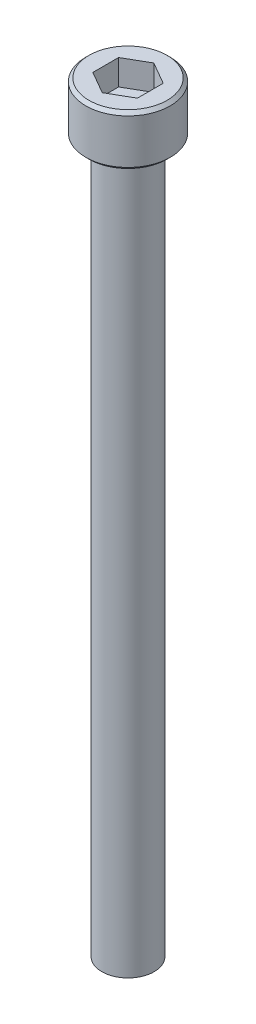
ISO-10303-21;
HEADER;
FILE_DESCRIPTION(('STEP AP214'),'2;1');
FILE_NAME('part.step','',(''),(''),'','','');
FILE_SCHEMA(('AUTOMOTIVE_DESIGN { 1 0 10303 214 1 1 1 1 }'));
ENDSEC;
DATA;
#1=APPLICATION_CONTEXT('core data for automotive mechanical design processes');
#2=APPLICATION_PROTOCOL_DEFINITION('international standard','automotive_design',2000,#1);
#3=PRODUCT_CONTEXT('',#1,'mechanical');
#4=PRODUCT('Part','Part','',(#3));
#5=PRODUCT_RELATED_PRODUCT_CATEGORY('part','',(#4));
#6=PRODUCT_DEFINITION_FORMATION('','',#4);
#7=PRODUCT_DEFINITION_CONTEXT('part definition',#1,'design');
#8=PRODUCT_DEFINITION('design','',#6,#7);
#9=PRODUCT_DEFINITION_SHAPE('','',#8);
#10=(LENGTH_UNIT() NAMED_UNIT(*) SI_UNIT(.MILLI.,.METRE.));
#11=(NAMED_UNIT(*) PLANE_ANGLE_UNIT() SI_UNIT($,.RADIAN.));
#12=(NAMED_UNIT(*) SI_UNIT($,.STERADIAN.) SOLID_ANGLE_UNIT());
#13=UNCERTAINTY_MEASURE_WITH_UNIT(LENGTH_MEASURE(1.E-05),#10,'distance_accuracy_value','');
#14=(GEOMETRIC_REPRESENTATION_CONTEXT(3) GLOBAL_UNCERTAINTY_ASSIGNED_CONTEXT((#13)) GLOBAL_UNIT_ASSIGNED_CONTEXT((#10,
#11,#12)) REPRESENTATION_CONTEXT('',''));
#15=CARTESIAN_POINT('',(0.,0.,0.));
#16=DIRECTION('',(0.,0.,1.));
#17=DIRECTION('',(1.,0.,0.));
#18=AXIS2_PLACEMENT_3D('',#15,#16,#17);
#19=CARTESIAN_POINT('',(1.778,2.032,3.07958633585746));
#20=DIRECTION('',(0.,1.,0.));
#21=DIRECTION('',(0.,0.,1.));
#22=AXIS2_PLACEMENT_3D('',#19,#20,#21);
#23=PLANE('',#22);
#24=DIRECTION('',(-0.866025403784439,0.,0.5));
#25=VECTOR('',#24,1.);
#26=CARTESIAN_POINT('',(0.,2.032,-2.05305755723831));
#27=LINE('',#26,#25);
#28=CARTESIAN_POINT('',(0.,2.032,-2.05305755723831));
#29=VERTEX_POINT('',#28);
#30=CARTESIAN_POINT('',(-1.778,2.032,-1.02652877861915));
#31=VERTEX_POINT('',#30);
#32=EDGE_CURVE('E67',#29,#31,#27,.T.);
#33=ORIENTED_EDGE('',*,*,#32,.T.);
#34=DIRECTION('',(0.,0.,1.));
#35=VECTOR('',#34,1.);
#36=CARTESIAN_POINT('',(-1.778,2.032,-1.02652877861915));
#37=LINE('',#36,#35);
#38=CARTESIAN_POINT('',(-1.778,2.032,1.02652877861915));
#39=VERTEX_POINT('',#38);
#40=EDGE_CURVE('E69',#31,#39,#37,.T.);
#41=ORIENTED_EDGE('',*,*,#40,.T.);
#42=DIRECTION('',(0.866025403784439,0.,0.499999999999999));
#43=VECTOR('',#42,1.);
#44=CARTESIAN_POINT('',(-1.778,2.032,1.02652877861915));
#45=LINE('',#44,#43);
#46=CARTESIAN_POINT('',(0.,2.032,2.05305755723831));
#47=VERTEX_POINT('',#46);
#48=EDGE_CURVE('E71',#39,#47,#45,.T.);
#49=ORIENTED_EDGE('',*,*,#48,.T.);
#50=DIRECTION('',(0.866025403784439,0.,-0.5));
#51=VECTOR('',#50,1.);
#52=CARTESIAN_POINT('',(0.,2.032,2.05305755723831));
#53=LINE('',#52,#51);
#54=CARTESIAN_POINT('',(1.778,2.032,1.02652877861915));
#55=VERTEX_POINT('',#54);
#56=EDGE_CURVE('E126',#47,#55,#53,.T.);
#57=ORIENTED_EDGE('',*,*,#56,.T.);
#58=DIRECTION('',(0.,0.,-1.));
#59=VECTOR('',#58,1.);
#60=CARTESIAN_POINT('',(1.778,2.032,1.02652877861915));
#61=LINE('',#60,#59);
#62=CARTESIAN_POINT('',(1.778,2.032,-1.02652877861915));
#63=VERTEX_POINT('',#62);
#64=EDGE_CURVE('E131',#55,#63,#61,.T.);
#65=ORIENTED_EDGE('',*,*,#64,.T.);
#66=DIRECTION('',(-0.866025403784439,0.,-0.5));
#67=VECTOR('',#66,1.);
#68=CARTESIAN_POINT('',(1.778,2.032,-1.02652877861916));
#69=LINE('',#68,#67);
#70=EDGE_CURVE('E135',#63,#29,#69,.T.);
#71=ORIENTED_EDGE('',*,*,#70,.T.);
#72=EDGE_LOOP('',(#33,#41,#49,#57,#65,#71));
#73=FACE_BOUND('',#72,.T.);
#74=ADVANCED_FACE('F16',(#73),#23,.T.);
#75=CARTESIAN_POINT('',(-1.778,2.032,1.02652877861915));
#76=DIRECTION('',(-0.499999999999999,0.,0.866025403784439));
#77=DIRECTION('',(0.866025403784439,0.,0.499999999999999));
#78=AXIS2_PLACEMENT_3D('',#75,#76,#77);
#79=PLANE('',#78);
#80=DIRECTION('',(0.,1.,0.));
#81=VECTOR('',#80,1.);
#82=CARTESIAN_POINT('',(0.,2.032,2.05305755723831));
#83=LINE('',#82,#81);
#84=CARTESIAN_POINT('',(0.,4.064,2.05305755723831));
#85=VERTEX_POINT('',#84);
#86=EDGE_CURVE('E82',#85,#47,#83,.F.);
#87=ORIENTED_EDGE('',*,*,#86,.T.);
#88=ORIENTED_EDGE('',*,*,#48,.F.);
#89=DIRECTION('',(0.,1.,0.));
#90=VECTOR('',#89,1.);
#91=CARTESIAN_POINT('',(-1.778,2.032,1.02652877861915));
#92=LINE('',#91,#90);
#93=CARTESIAN_POINT('',(-1.778,4.064,1.02652877861915));
#94=VERTEX_POINT('',#93);
#95=EDGE_CURVE('E76',#39,#94,#92,.T.);
#96=ORIENTED_EDGE('',*,*,#95,.T.);
#97=DIRECTION('',(-0.866025403784439,0.,-0.499999999999999));
#98=VECTOR('',#97,1.);
#99=CARTESIAN_POINT('',(0.,4.064,2.05305755723831));
#100=LINE('',#99,#98);
#101=EDGE_CURVE('E123',#85,#94,#100,.T.);
#102=ORIENTED_EDGE('',*,*,#101,.F.);
#103=EDGE_LOOP('',(#87,#88,#96,#102));
#104=FACE_BOUND('',#103,.T.);
#105=ADVANCED_FACE('F79',(#104),#79,.F.);
#106=CARTESIAN_POINT('',(-1.778,2.032,-1.02652877861915));
#107=DIRECTION('',(-1.,0.,0.));
#108=DIRECTION('',(0.,0.,1.));
#109=AXIS2_PLACEMENT_3D('',#106,#107,#108);
#110=PLANE('',#109);
#111=ORIENTED_EDGE('',*,*,#95,.F.);
#112=ORIENTED_EDGE('',*,*,#40,.F.);
#113=DIRECTION('',(0.,1.,0.));
#114=VECTOR('',#113,1.);
#115=CARTESIAN_POINT('',(-1.778,2.032,-1.02652877861915));
#116=LINE('',#115,#114);
#117=CARTESIAN_POINT('',(-1.778,4.064,-1.02652877861915));
#118=VERTEX_POINT('',#117);
#119=EDGE_CURVE('E90',#31,#118,#116,.T.);
#120=ORIENTED_EDGE('',*,*,#119,.T.);
#121=DIRECTION('',(0.,0.,1.));
#122=VECTOR('',#121,1.);
#123=CARTESIAN_POINT('',(-1.778,4.064,0.));
#124=LINE('',#123,#122);
#125=EDGE_CURVE('E87',#94,#118,#124,.F.);
#126=ORIENTED_EDGE('',*,*,#125,.F.);
#127=EDGE_LOOP('',(#111,#112,#120,#126));
#128=FACE_BOUND('',#127,.T.);
#129=ADVANCED_FACE('F85',(#128),#110,.F.);
#130=CARTESIAN_POINT('',(0.,2.032,-2.05305755723831));
#131=DIRECTION('',(-0.5,0.,-0.866025403784439));
#132=DIRECTION('',(-0.866025403784439,0.,0.5));
#133=AXIS2_PLACEMENT_3D('',#130,#131,#132);
#134=PLANE('',#133);
#135=ORIENTED_EDGE('',*,*,#119,.F.);
#136=ORIENTED_EDGE('',*,*,#32,.F.);
#137=DIRECTION('',(0.,1.,0.));
#138=VECTOR('',#137,1.);
#139=CARTESIAN_POINT('',(0.,2.032,-2.05305755723831));
#140=LINE('',#139,#138);
#141=CARTESIAN_POINT('',(0.,4.064,-2.05305755723831));
#142=VERTEX_POINT('',#141);
#143=EDGE_CURVE('E133',#29,#142,#140,.T.);
#144=ORIENTED_EDGE('',*,*,#143,.T.);
#145=DIRECTION('',(0.866025403784438,0.,-0.5));
#146=VECTOR('',#145,1.);
#147=CARTESIAN_POINT('',(-1.778,4.064,-1.02652877861915));
#148=LINE('',#147,#146);
#149=EDGE_CURVE('E119',#118,#142,#148,.T.);
#150=ORIENTED_EDGE('',*,*,#149,.F.);
#151=EDGE_LOOP('',(#135,#136,#144,#150));
#152=FACE_BOUND('',#151,.T.);
#153=ADVANCED_FACE('F138',(#152),#134,.F.);
#154=CARTESIAN_POINT('',(1.778,2.032,-1.02652877861916));
#155=DIRECTION('',(0.5,0.,-0.866025403784439));
#156=DIRECTION('',(-0.866025403784439,0.,-0.5));
#157=AXIS2_PLACEMENT_3D('',#154,#155,#156);
#158=PLANE('',#157);
#159=ORIENTED_EDGE('',*,*,#143,.F.);
#160=ORIENTED_EDGE('',*,*,#70,.F.);
#161=DIRECTION('',(0.,1.,0.));
#162=VECTOR('',#161,1.);
#163=CARTESIAN_POINT('',(1.778,2.032,-1.02652877861916));
#164=LINE('',#163,#162);
#165=CARTESIAN_POINT('',(1.778,4.064,-1.02652877861916));
#166=VERTEX_POINT('',#165);
#167=EDGE_CURVE('E129',#63,#166,#164,.T.);
#168=ORIENTED_EDGE('',*,*,#167,.T.);
#169=DIRECTION('',(0.866025403784439,0.,0.5));
#170=VECTOR('',#169,1.);
#171=CARTESIAN_POINT('',(0.,4.064,-2.05305755723831));
#172=LINE('',#171,#170);
#173=EDGE_CURVE('E116',#142,#166,#172,.T.);
#174=ORIENTED_EDGE('',*,*,#173,.F.);
#175=EDGE_LOOP('',(#159,#160,#168,#174));
#176=FACE_BOUND('',#175,.T.);
#177=ADVANCED_FACE('F150',(#176),#158,.F.);
#178=CARTESIAN_POINT('',(1.778,2.032,1.02652877861915));
#179=DIRECTION('',(1.,0.,0.));
#180=DIRECTION('',(0.,0.,-1.));
#181=AXIS2_PLACEMENT_3D('',#178,#179,#180);
#182=PLANE('',#181);
#183=ORIENTED_EDGE('',*,*,#167,.F.);
#184=ORIENTED_EDGE('',*,*,#64,.F.);
#185=DIRECTION('',(0.,1.,0.));
#186=VECTOR('',#185,1.);
#187=CARTESIAN_POINT('',(1.778,2.032,1.02652877861915));
#188=LINE('',#187,#186);
#189=CARTESIAN_POINT('',(1.778,4.064,1.02652877861915));
#190=VERTEX_POINT('',#189);
#191=EDGE_CURVE('E34',#55,#190,#188,.T.);
#192=ORIENTED_EDGE('',*,*,#191,.T.);
#193=DIRECTION('',(0.,0.,1.));
#194=VECTOR('',#193,1.);
#195=CARTESIAN_POINT('',(1.778,4.064,0.));
#196=LINE('',#195,#194);
#197=EDGE_CURVE('E113',#166,#190,#196,.T.);
#198=ORIENTED_EDGE('',*,*,#197,.F.);
#199=EDGE_LOOP('',(#183,#184,#192,#198));
#200=FACE_BOUND('',#199,.T.);
#201=ADVANCED_FACE('F148',(#200),#182,.F.);
#202=CARTESIAN_POINT('',(0.,2.032,2.05305755723831));
#203=DIRECTION('',(0.5,0.,0.866025403784439));
#204=DIRECTION('',(0.866025403784439,0.,-0.5));
#205=AXIS2_PLACEMENT_3D('',#202,#203,#204);
#206=PLANE('',#205);
#207=ORIENTED_EDGE('',*,*,#191,.F.);
#208=ORIENTED_EDGE('',*,*,#56,.F.);
#209=ORIENTED_EDGE('',*,*,#86,.F.);
#210=DIRECTION('',(-0.866025403784438,0.,0.5));
#211=VECTOR('',#210,1.);
#212=CARTESIAN_POINT('',(1.778,4.064,1.02652877861915));
#213=LINE('',#212,#211);
#214=EDGE_CURVE('E110',#190,#85,#213,.T.);
#215=ORIENTED_EDGE('',*,*,#214,.F.);
#216=EDGE_LOOP('',(#207,#208,#209,#215));
#217=FACE_BOUND('',#216,.T.);
#218=ADVANCED_FACE('F145',(#217),#206,.F.);
#219=CARTESIAN_POINT('',(0.,4.064,0.));
#220=DIRECTION('',(0.,1.,0.));
#221=DIRECTION('',(0.,0.,1.));
#222=AXIS2_PLACEMENT_3D('',#219,#220,#221);
#223=PLANE('',#222);
#224=ORIENTED_EDGE('',*,*,#197,.T.);
#225=ORIENTED_EDGE('',*,*,#214,.T.);
#226=ORIENTED_EDGE('',*,*,#101,.T.);
#227=ORIENTED_EDGE('',*,*,#125,.T.);
#228=ORIENTED_EDGE('',*,*,#149,.T.);
#229=ORIENTED_EDGE('',*,*,#173,.T.);
#230=EDGE_LOOP('',(#224,#225,#226,#227,#228,#229));
#231=FACE_BOUND('',#230,.T.);
#232=CARTESIAN_POINT('',(0.,4.0639999999712,0.));
#233=DIRECTION('',(0.,-1.,0.));
#234=DIRECTION('',(0.,0.,-1.));
#235=AXIS2_PLACEMENT_3D('',#232,#233,#234);
#236=CIRCLE('',#235,3.11149999998861);
#237=CARTESIAN_POINT('',(0.,4.0639999999712,-3.11149999998861));
#238=VERTEX_POINT('',#237);
#239=EDGE_CURVE('E19',#238,#238,#236,.T.);
#240=ORIENTED_EDGE('',*,*,#239,.F.);
#241=EDGE_LOOP('',(#240));
#242=FACE_BOUND('',#241,.T.);
#243=ADVANCED_FACE('F142',(#231,#242),#223,.T.);
#244=CARTESIAN_POINT('',(0.,3.80999999998721,0.));
#245=DIRECTION('',(0.,-1.,0.));
#246=DIRECTION('',(0.,0.,-1.));
#247=AXIS2_PLACEMENT_3D('',#244,#245,#246);
#248=CONICAL_SURFACE('',#247,3.3654999999726,0.785398163397448);
#249=ORIENTED_EDGE('',*,*,#239,.T.);
#250=EDGE_LOOP('',(#249));
#251=FACE_BOUND('',#250,.T.);
#252=CARTESIAN_POINT('',(0.,3.81,0.));
#253=DIRECTION('',(0.,-1.,0.));
#254=DIRECTION('',(0.,0.,-1.));
#255=AXIS2_PLACEMENT_3D('',#252,#253,#254);
#256=CIRCLE('',#255,3.3655);
#257=CARTESIAN_POINT('',(0.,3.81,-3.3655));
#258=VERTEX_POINT('',#257);
#259=EDGE_CURVE('E102',#258,#258,#256,.T.);
#260=ORIENTED_EDGE('',*,*,#259,.F.);
#261=EDGE_LOOP('',(#260));
#262=FACE_BOUND('',#261,.T.);
#263=ADVANCED_FACE('F187',(#251,#262),#248,.T.);
#264=CARTESIAN_POINT('',(0.,4.064,0.));
#265=DIRECTION('',(0.,-1.,0.));
#266=DIRECTION('',(0.,0.,-1.));
#267=AXIS2_PLACEMENT_3D('',#264,#265,#266);
#268=CYLINDRICAL_SURFACE('',#267,3.3655);
#269=ORIENTED_EDGE('',*,*,#259,.T.);
#270=EDGE_LOOP('',(#269));
#271=FACE_BOUND('',#270,.T.);
#272=CARTESIAN_POINT('',(0.,0.254000000040833,0.));
#273=DIRECTION('',(0.,1.,0.));
#274=DIRECTION('',(0.,0.,1.));
#275=AXIS2_PLACEMENT_3D('',#272,#273,#274);
#276=CIRCLE('',#275,3.3654999999726);
#277=CARTESIAN_POINT('',(0.,0.254000000040833,3.3654999999726));
#278=VERTEX_POINT('',#277);
#279=EDGE_CURVE('E98',#278,#278,#276,.F.);
#280=ORIENTED_EDGE('',*,*,#279,.F.);
#281=EDGE_LOOP('',(#280));
#282=FACE_BOUND('',#281,.T.);
#283=ADVANCED_FACE('F183',(#271,#282),#268,.T.);
#284=CARTESIAN_POINT('',(0.,-57.15,0.));
#285=DIRECTION('',(0.,1.,0.));
#286=DIRECTION('',(0.,0.,1.));
#287=AXIS2_PLACEMENT_3D('',#284,#285,#286);
#288=PLANE('',#287);
#289=CARTESIAN_POINT('',(0.,-57.1499999999617,0.));
#290=DIRECTION('',(0.,1.,0.));
#291=DIRECTION('',(0.,0.,1.));
#292=AXIS2_PLACEMENT_3D('',#289,#290,#291);
#293=CIRCLE('',#292,1.31318000001102);
#294=CARTESIAN_POINT('',(0.,-57.1499999999617,1.31318000001102));
#295=VERTEX_POINT('',#294);
#296=EDGE_CURVE('E96',#295,#295,#293,.T.);
#297=ORIENTED_EDGE('',*,*,#296,.F.);
#298=EDGE_LOOP('',(#297));
#299=FACE_BOUND('',#298,.T.);
#300=ADVANCED_FACE('F179',(#299),#288,.F.);
#301=CARTESIAN_POINT('',(0.,0.254000000040833,0.));
#302=DIRECTION('',(0.,1.,0.));
#303=DIRECTION('',(0.,0.,1.));
#304=AXIS2_PLACEMENT_3D('',#301,#302,#303);
#305=CONICAL_SURFACE('',#304,3.3654999999726,0.785398163397448);
#306=CARTESIAN_POINT('',(0.,5.6843418860808E-11,0.));
#307=DIRECTION('',(0.,1.,0.));
#308=DIRECTION('',(0.,0.,1.));
#309=AXIS2_PLACEMENT_3D('',#306,#307,#308);
#310=CIRCLE('',#309,3.11149999998861);
#311=CARTESIAN_POINT('',(0.,5.6843418860808E-11,3.11149999998861));
#312=VERTEX_POINT('',#311);
#313=EDGE_CURVE('E94',#312,#312,#310,.T.);
#314=ORIENTED_EDGE('',*,*,#313,.T.);
#315=EDGE_LOOP('',(#314));
#316=FACE_BOUND('',#315,.T.);
#317=ORIENTED_EDGE('',*,*,#279,.T.);
#318=EDGE_LOOP('',(#317));
#319=FACE_BOUND('',#318,.T.);
#320=ADVANCED_FACE('F175',(#316,#319),#305,.T.);
#321=CARTESIAN_POINT('',(0.,-56.6115199999899,0.));
#322=DIRECTION('',(0.,1.,0.));
#323=DIRECTION('',(0.,0.,1.));
#324=AXIS2_PLACEMENT_3D('',#321,#322,#323);
#325=CONICAL_SURFACE('',#324,2.0827999999824,0.960291895417683);
#326=CARTESIAN_POINT('',(0.,-56.61152,0.));
#327=DIRECTION('',(0.,1.,0.));
#328=DIRECTION('',(0.,0.,1.));
#329=AXIS2_PLACEMENT_3D('',#326,#327,#328);
#330=CIRCLE('',#329,2.0828);
#331=CARTESIAN_POINT('',(0.,-56.61152,2.0828));
#332=VERTEX_POINT('',#331);
#333=EDGE_CURVE('E25',#332,#332,#330,.T.);
#334=ORIENTED_EDGE('',*,*,#333,.F.);
#335=EDGE_LOOP('',(#334));
#336=FACE_BOUND('',#335,.T.);
#337=ORIENTED_EDGE('',*,*,#296,.T.);
#338=EDGE_LOOP('',(#337));
#339=FACE_BOUND('',#338,.T.);
#340=ADVANCED_FACE('F168',(#336,#339),#325,.T.);
#341=CARTESIAN_POINT('',(0.,0.,0.));
#342=DIRECTION('',(0.,1.,0.));
#343=DIRECTION('',(0.,0.,1.));
#344=AXIS2_PLACEMENT_3D('',#341,#342,#343);
#345=PLANE('',#344);
#346=CARTESIAN_POINT('',(0.,0.,0.));
#347=DIRECTION('',(0.,1.,0.));
#348=DIRECTION('',(0.,0.,1.));
#349=AXIS2_PLACEMENT_3D('',#346,#347,#348);
#350=CIRCLE('',#349,2.0828);
#351=CARTESIAN_POINT('',(0.,0.,2.0828));
#352=VERTEX_POINT('',#351);
#353=EDGE_CURVE('E11',#352,#352,#350,.F.);
#354=ORIENTED_EDGE('',*,*,#353,.F.);
#355=EDGE_LOOP('',(#354));
#356=FACE_BOUND('',#355,.T.);
#357=ORIENTED_EDGE('',*,*,#313,.F.);
#358=EDGE_LOOP('',(#357));
#359=FACE_BOUND('',#358,.T.);
#360=ADVANCED_FACE('F162',(#356,#359),#345,.F.);
#361=CARTESIAN_POINT('',(0.,-57.15,0.));
#362=DIRECTION('',(0.,1.,0.));
#363=DIRECTION('',(0.,0.,1.));
#364=AXIS2_PLACEMENT_3D('',#361,#362,#363);
#365=CYLINDRICAL_SURFACE('',#364,2.0828);
#366=ORIENTED_EDGE('',*,*,#353,.T.);
#367=EDGE_LOOP('',(#366));
#368=FACE_BOUND('',#367,.T.);
#369=ORIENTED_EDGE('',*,*,#333,.T.);
#370=EDGE_LOOP('',(#369));
#371=FACE_BOUND('',#370,.T.);
#372=ADVANCED_FACE('F160',(#368,#371),#365,.T.);
#373=CLOSED_SHELL('',(#74,#105,#129,#153,#177,#201,#218,#243,#263,#283,#300,#320,#340,#360,#372));
#374=MANIFOLD_SOLID_BREP('B1',#373);
#375=ADVANCED_BREP_SHAPE_REPRESENTATION('',(#18,#374),#14);
#376=SHAPE_DEFINITION_REPRESENTATION(#9,#375);
ENDSEC;
END-ISO-10303-21;
